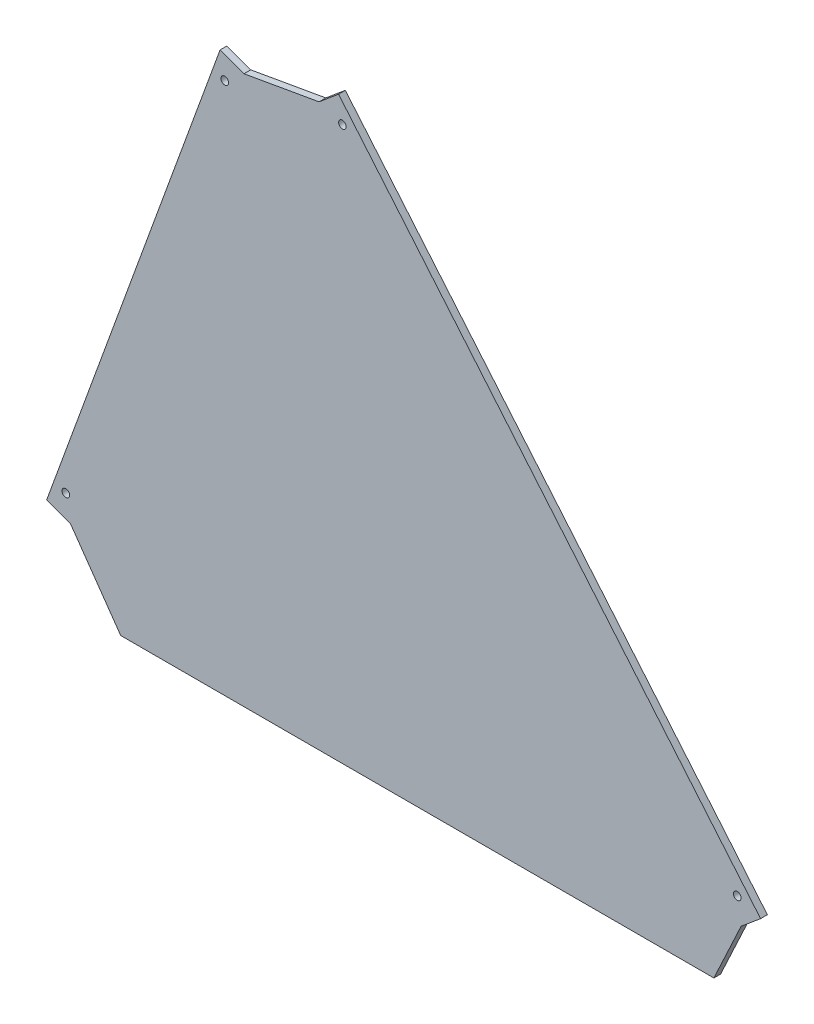
ISO-10303-21;
HEADER;
FILE_DESCRIPTION(('STEP AP214'),'2;1');
FILE_NAME('part.step','',(''),(''),'','','');
FILE_SCHEMA(('AUTOMOTIVE_DESIGN { 1 0 10303 214 1 1 1 1 }'));
ENDSEC;
DATA;
#1=APPLICATION_CONTEXT('core data for automotive mechanical design processes');
#2=APPLICATION_PROTOCOL_DEFINITION('international standard','automotive_design',2000,#1);
#3=PRODUCT_CONTEXT('',#1,'mechanical');
#4=PRODUCT('Part','Part','',(#3));
#5=PRODUCT_RELATED_PRODUCT_CATEGORY('part','',(#4));
#6=PRODUCT_DEFINITION_FORMATION('','',#4);
#7=PRODUCT_DEFINITION_CONTEXT('part definition',#1,'design');
#8=PRODUCT_DEFINITION('design','',#6,#7);
#9=PRODUCT_DEFINITION_SHAPE('','',#8);
#10=(LENGTH_UNIT() NAMED_UNIT(*) SI_UNIT(.MILLI.,.METRE.));
#11=(NAMED_UNIT(*) PLANE_ANGLE_UNIT() SI_UNIT($,.RADIAN.));
#12=(NAMED_UNIT(*) SI_UNIT($,.STERADIAN.) SOLID_ANGLE_UNIT());
#13=UNCERTAINTY_MEASURE_WITH_UNIT(LENGTH_MEASURE(1.E-05),#10,'distance_accuracy_value','');
#14=(GEOMETRIC_REPRESENTATION_CONTEXT(3) GLOBAL_UNCERTAINTY_ASSIGNED_CONTEXT((#13)) GLOBAL_UNIT_ASSIGNED_CONTEXT((#10,
#11,#12)) REPRESENTATION_CONTEXT('',''));
#15=CARTESIAN_POINT('',(0.,0.,0.));
#16=DIRECTION('',(0.,0.,1.));
#17=DIRECTION('',(1.,0.,0.));
#18=AXIS2_PLACEMENT_3D('',#15,#16,#17);
#19=CARTESIAN_POINT('',(324.450552913093,-151.293777515997,4.));
#20=DIRECTION('',(0.906307787036652,-0.422618261740696,0.));
#21=DIRECTION('',(0.422618261740696,0.906307787036652,0.));
#22=AXIS2_PLACEMENT_3D('',#19,#20,#21);
#23=PLANE('',#22);
#24=DIRECTION('',(-0.422618261740696,-0.906307787036652,0.));
#25=VECTOR('',#24,1.);
#26=CARTESIAN_POINT('',(324.450552913093,-151.293777515997,0.));
#27=LINE('',#26,#25);
#28=CARTESIAN_POINT('',(411.074557564106,34.4719999403538,0.));
#29=VERTEX_POINT('',#28);
#30=CARTESIAN_POINT('',(395.,0.,0.));
#31=VERTEX_POINT('',#30);
#32=EDGE_CURVE('E161',#29,#31,#27,.T.);
#33=ORIENTED_EDGE('',*,*,#32,.F.);
#34=DIRECTION('',(0.,0.,-1.));
#35=VECTOR('',#34,1.);
#36=CARTESIAN_POINT('',(411.074557564106,34.4719999403538,4.));
#37=LINE('',#36,#35);
#38=CARTESIAN_POINT('',(411.074557564106,34.4719999403538,4.));
#39=VERTEX_POINT('',#38);
#40=EDGE_CURVE('E11',#39,#29,#37,.T.);
#41=ORIENTED_EDGE('',*,*,#40,.F.);
#42=DIRECTION('',(-0.422618261740696,-0.906307787036652,0.));
#43=VECTOR('',#42,1.);
#44=CARTESIAN_POINT('',(324.450552913093,-151.293777515997,4.));
#45=LINE('',#44,#43);
#46=CARTESIAN_POINT('',(395.,0.,4.));
#47=VERTEX_POINT('',#46);
#48=EDGE_CURVE('E196',#39,#47,#45,.T.);
#49=ORIENTED_EDGE('',*,*,#48,.T.);
#50=DIRECTION('',(0.,0.,-1.));
#51=VECTOR('',#50,1.);
#52=CARTESIAN_POINT('',(395.,0.,4.));
#53=LINE('',#52,#51);
#54=EDGE_CURVE('E66',#47,#31,#53,.T.);
#55=ORIENTED_EDGE('',*,*,#54,.T.);
#56=EDGE_LOOP('',(#33,#41,#49,#55));
#57=FACE_BOUND('',#56,.T.);
#58=ADVANCED_FACE('F49',(#57),#23,.T.);
#59=CARTESIAN_POINT('',(152.871958477384,-182.185705722332,4.));
#60=DIRECTION('',(-0.642787609686544,0.766044443118974,0.));
#61=DIRECTION('',(-0.766044443118974,-0.642787609686544,0.));
#62=AXIS2_PLACEMENT_3D('',#59,#60,#61);
#63=PLANE('',#62);
#64=DIRECTION('',(0.766044443118974,0.642787609686544,0.));
#65=VECTOR('',#64,1.);
#66=CARTESIAN_POINT('',(152.871958477384,-182.185705722332,0.));
#67=LINE('',#66,#65);
#68=CARTESIAN_POINT('',(422.56522421089,44.1138140856518,0.));
#69=VERTEX_POINT('',#68);
#70=EDGE_CURVE('E164',#29,#69,#67,.T.);
#71=ORIENTED_EDGE('',*,*,#70,.T.);
#72=DIRECTION('',(0.,0.,-1.));
#73=VECTOR('',#72,1.);
#74=CARTESIAN_POINT('',(422.56522421089,44.1138140856518,4.));
#75=LINE('',#74,#73);
#76=CARTESIAN_POINT('',(422.56522421089,44.1138140856518,4.));
#77=VERTEX_POINT('',#76);
#78=EDGE_CURVE('E58',#77,#69,#75,.T.);
#79=ORIENTED_EDGE('',*,*,#78,.F.);
#80=DIRECTION('',(0.766044443118974,0.642787609686544,0.));
#81=VECTOR('',#80,1.);
#82=CARTESIAN_POINT('',(152.871958477384,-182.185705722332,4.));
#83=LINE('',#82,#81);
#84=EDGE_CURVE('E238',#39,#77,#83,.T.);
#85=ORIENTED_EDGE('',*,*,#84,.F.);
#86=ORIENTED_EDGE('',*,*,#40,.T.);
#87=EDGE_LOOP('',(#71,#79,#85,#86));
#88=FACE_BOUND('',#87,.T.);
#89=ADVANCED_FACE('F225',(#88),#63,.F.);
#90=CARTESIAN_POINT('',(269.693265733507,226.299519807984,4.));
#91=DIRECTION('',(0.766044443118974,0.642787609686544,0.));
#92=DIRECTION('',(-0.642787609686544,0.766044443118974,0.));
#93=AXIS2_PLACEMENT_3D('',#90,#91,#92);
#94=PLANE('',#93);
#95=DIRECTION('',(0.642787609686544,-0.766044443118974,0.));
#96=VECTOR('',#95,1.);
#97=CARTESIAN_POINT('',(269.693265733507,226.299519807984,0.));
#98=LINE('',#97,#96);
#99=CARTESIAN_POINT('',(173.531323483043,340.90085995581,0.));
#100=VERTEX_POINT('',#99);
#101=EDGE_CURVE('E169',#100,#69,#98,.T.);
#102=ORIENTED_EDGE('',*,*,#101,.F.);
#103=DIRECTION('',(0.,0.,-1.));
#104=VECTOR('',#103,1.);
#105=CARTESIAN_POINT('',(173.531323483043,340.90085995581,4.));
#106=LINE('',#105,#104);
#107=CARTESIAN_POINT('',(173.531323483043,340.90085995581,4.));
#108=VERTEX_POINT('',#107);
#109=EDGE_CURVE('E213',#108,#100,#106,.T.);
#110=ORIENTED_EDGE('',*,*,#109,.F.);
#111=DIRECTION('',(0.642787609686544,-0.766044443118974,0.));
#112=VECTOR('',#111,1.);
#113=CARTESIAN_POINT('',(269.693265733507,226.299519807984,4.));
#114=LINE('',#113,#112);
#115=EDGE_CURVE('E222',#108,#77,#114,.T.);
#116=ORIENTED_EDGE('',*,*,#115,.T.);
#117=ORIENTED_EDGE('',*,*,#78,.T.);
#118=EDGE_LOOP('',(#102,#110,#116,#117));
#119=FACE_BOUND('',#118,.T.);
#120=ADVANCED_FACE('F220',(#119),#94,.T.);
#121=CARTESIAN_POINT('',(-96.1619422504636,114.601340147826,4.));
#122=DIRECTION('',(-0.642787609686543,0.766044443118975,0.));
#123=DIRECTION('',(-0.766044443118975,-0.642787609686543,0.));
#124=AXIS2_PLACEMENT_3D('',#121,#122,#123);
#125=PLANE('',#124);
#126=DIRECTION('',(0.766044443118975,0.642787609686543,0.));
#127=VECTOR('',#126,1.);
#128=CARTESIAN_POINT('',(-96.1619422504636,114.601340147826,0.));
#129=LINE('',#128,#127);
#130=CARTESIAN_POINT('',(162.040656836259,331.259045810512,0.));
#131=VERTEX_POINT('',#130);
#132=EDGE_CURVE('E173',#131,#100,#129,.T.);
#133=ORIENTED_EDGE('',*,*,#132,.F.);
#134=DIRECTION('',(0.,0.,-1.));
#135=VECTOR('',#134,1.);
#136=CARTESIAN_POINT('',(162.040656836259,331.259045810512,4.));
#137=LINE('',#136,#135);
#138=CARTESIAN_POINT('',(162.040656836259,331.259045810512,4.));
#139=VERTEX_POINT('',#138);
#140=EDGE_CURVE('E210',#139,#131,#137,.T.);
#141=ORIENTED_EDGE('',*,*,#140,.F.);
#142=DIRECTION('',(0.766044443118975,0.642787609686543,0.));
#143=VECTOR('',#142,1.);
#144=CARTESIAN_POINT('',(-96.1619422504636,114.601340147826,4.));
#145=LINE('',#144,#143);
#146=EDGE_CURVE('E235',#139,#108,#145,.T.);
#147=ORIENTED_EDGE('',*,*,#146,.T.);
#148=ORIENTED_EDGE('',*,*,#109,.T.);
#149=EDGE_LOOP('',(#133,#141,#147,#148));
#150=FACE_BOUND('',#149,.T.);
#151=ADVANCED_FACE('F232',(#150),#125,.T.);
#152=CARTESIAN_POINT('',(-51.7625094930564,293.559779025753,4.));
#153=DIRECTION('',(-0.173648177666934,0.984807753012207,0.));
#154=DIRECTION('',(-0.984807753012207,-0.173648177666934,0.));
#155=AXIS2_PLACEMENT_3D('',#152,#153,#154);
#156=PLANE('',#155);
#157=DIRECTION('',(0.984807753012207,0.173648177666935,0.));
#158=VECTOR('',#157,1.);
#159=CARTESIAN_POINT('',(-51.7625094930564,293.559779025753,0.));
#160=LINE('',#159,#158);
#161=CARTESIAN_POINT('',(117.724307950709,323.4448778155,0.));
#162=VERTEX_POINT('',#161);
#163=EDGE_CURVE('E176',#162,#131,#160,.T.);
#164=ORIENTED_EDGE('',*,*,#163,.F.);
#165=DIRECTION('',(0.,0.,-1.));
#166=VECTOR('',#165,1.);
#167=CARTESIAN_POINT('',(117.724307950709,323.4448778155,4.));
#168=LINE('',#167,#166);
#169=CARTESIAN_POINT('',(117.724307950709,323.4448778155,4.));
#170=VERTEX_POINT('',#169);
#171=EDGE_CURVE('E207',#170,#162,#168,.T.);
#172=ORIENTED_EDGE('',*,*,#171,.F.);
#173=DIRECTION('',(0.984807753012207,0.173648177666935,0.));
#174=VECTOR('',#173,1.);
#175=CARTESIAN_POINT('',(-51.7625094930564,293.559779025753,4.));
#176=LINE('',#175,#174);
#177=EDGE_CURVE('E242',#170,#139,#176,.T.);
#178=ORIENTED_EDGE('',*,*,#177,.T.);
#179=ORIENTED_EDGE('',*,*,#140,.T.);
#180=EDGE_LOOP('',(#164,#172,#178,#179));
#181=FACE_BOUND('',#180,.T.);
#182=ADVANCED_FACE('F337',(#181),#156,.T.);
#183=CARTESIAN_POINT('',(117.724307950709,323.4448778155,4.));
#184=DIRECTION('',(-0.342020143325665,-0.93969262078591,0.));
#185=DIRECTION('',(0.93969262078591,-0.342020143325665,0.));
#186=AXIS2_PLACEMENT_3D('',#183,#184,#185);
#187=PLANE('',#186);
#188=DIRECTION('',(-0.93969262078591,0.342020143325665,0.));
#189=VECTOR('',#188,1.);
#190=CARTESIAN_POINT('',(117.724307950709,323.4448778155,0.));
#191=LINE('',#190,#189);
#192=CARTESIAN_POINT('',(103.628918638921,328.575179965385,0.));
#193=VERTEX_POINT('',#192);
#194=EDGE_CURVE('E180',#162,#193,#191,.T.);
#195=ORIENTED_EDGE('',*,*,#194,.T.);
#196=DIRECTION('',(0.,0.,-1.));
#197=VECTOR('',#196,1.);
#198=CARTESIAN_POINT('',(103.628918638921,328.575179965385,4.));
#199=LINE('',#198,#197);
#200=CARTESIAN_POINT('',(103.628918638921,328.575179965385,4.));
#201=VERTEX_POINT('',#200);
#202=EDGE_CURVE('E203',#201,#193,#199,.T.);
#203=ORIENTED_EDGE('',*,*,#202,.F.);
#204=DIRECTION('',(-0.93969262078591,0.342020143325665,0.));
#205=VECTOR('',#204,1.);
#206=CARTESIAN_POINT('',(117.724307950709,323.4448778155,4.));
#207=LINE('',#206,#205);
#208=EDGE_CURVE('E250',#170,#201,#207,.T.);
#209=ORIENTED_EDGE('',*,*,#208,.F.);
#210=ORIENTED_EDGE('',*,*,#171,.T.);
#211=EDGE_LOOP('',(#195,#203,#209,#210));
#212=FACE_BOUND('',#211,.T.);
#213=ADVANCED_FACE('F333',(#212),#187,.F.);
#214=CARTESIAN_POINT('',(-14.0953893117887,5.130302149885,4.));
#215=DIRECTION('',(0.93969262078591,-0.342020143325666,0.));
#216=DIRECTION('',(0.342020143325666,0.93969262078591,0.));
#217=AXIS2_PLACEMENT_3D('',#214,#215,#216);
#218=PLANE('',#217);
#219=DIRECTION('',(-0.342020143325666,-0.93969262078591,0.));
#220=VECTOR('',#219,1.);
#221=CARTESIAN_POINT('',(-14.0953893117887,5.130302149885,0.));
#222=LINE('',#221,#220);
#223=CARTESIAN_POINT('',(1.29551713786626,47.4164700852509,0.));
#224=VERTEX_POINT('',#223);
#225=EDGE_CURVE('E183',#193,#224,#222,.T.);
#226=ORIENTED_EDGE('',*,*,#225,.T.);
#227=DIRECTION('',(0.,0.,-1.));
#228=VECTOR('',#227,1.);
#229=CARTESIAN_POINT('',(1.29551713786626,47.4164700852509,4.));
#230=LINE('',#229,#228);
#231=CARTESIAN_POINT('',(1.29551713786626,47.4164700852509,4.));
#232=VERTEX_POINT('',#231);
#233=EDGE_CURVE('E138',#232,#224,#230,.T.);
#234=ORIENTED_EDGE('',*,*,#233,.F.);
#235=DIRECTION('',(-0.342020143325666,-0.93969262078591,0.));
#236=VECTOR('',#235,1.);
#237=CARTESIAN_POINT('',(-14.0953893117887,5.130302149885,4.));
#238=LINE('',#237,#236);
#239=EDGE_CURVE('E147',#201,#232,#238,.T.);
#240=ORIENTED_EDGE('',*,*,#239,.F.);
#241=ORIENTED_EDGE('',*,*,#202,.T.);
#242=EDGE_LOOP('',(#226,#234,#240,#241));
#243=FACE_BOUND('',#242,.T.);
#244=ADVANCED_FACE('F330',(#243),#218,.F.);
#245=CARTESIAN_POINT('',(15.390906449655,42.2861679353659,4.));
#246=DIRECTION('',(-0.342020143325666,-0.939692620785909,0.));
#247=DIRECTION('',(0.93969262078591,-0.342020143325666,0.));
#248=AXIS2_PLACEMENT_3D('',#245,#246,#247);
#249=PLANE('',#248);
#250=DIRECTION('',(-0.93969262078591,0.342020143325666,0.));
#251=VECTOR('',#250,1.);
#252=CARTESIAN_POINT('',(15.390906449655,42.2861679353659,0.));
#253=LINE('',#252,#251);
#254=CARTESIAN_POINT('',(15.3909064496549,42.2861679353659,0.));
#255=VERTEX_POINT('',#254);
#256=EDGE_CURVE('E133',#255,#224,#253,.T.);
#257=ORIENTED_EDGE('',*,*,#256,.F.);
#258=DIRECTION('',(0.,0.,-1.));
#259=VECTOR('',#258,1.);
#260=CARTESIAN_POINT('',(15.3909064496549,42.2861679353659,4.));
#261=LINE('',#260,#259);
#262=CARTESIAN_POINT('',(15.3909064496549,42.2861679353659,4.));
#263=VERTEX_POINT('',#262);
#264=EDGE_CURVE('E128',#263,#255,#261,.T.);
#265=ORIENTED_EDGE('',*,*,#264,.F.);
#266=DIRECTION('',(-0.93969262078591,0.342020143325666,0.));
#267=VECTOR('',#266,1.);
#268=CARTESIAN_POINT('',(15.390906449655,42.2861679353659,4.));
#269=LINE('',#268,#267);
#270=EDGE_CURVE('E131',#263,#232,#269,.T.);
#271=ORIENTED_EDGE('',*,*,#270,.T.);
#272=ORIENTED_EDGE('',*,*,#233,.T.);
#273=EDGE_LOOP('',(#257,#265,#271,#272));
#274=FACE_BOUND('',#273,.T.);
#275=ADVANCED_FACE('F130',(#274),#249,.T.);
#276=CARTESIAN_POINT('',(30.1954532248275,21.143083967683,4.));
#277=DIRECTION('',(-0.819152044288991,-0.573576436351047,0.));
#278=DIRECTION('',(0.573576436351047,-0.819152044288991,0.));
#279=AXIS2_PLACEMENT_3D('',#276,#277,#278);
#280=PLANE('',#279);
#281=DIRECTION('',(-0.573576436351047,0.819152044288991,0.));
#282=VECTOR('',#281,1.);
#283=CARTESIAN_POINT('',(30.1954532248275,21.143083967683,0.));
#284=LINE('',#283,#282);
#285=CARTESIAN_POINT('',(45.,0.,0.));
#286=VERTEX_POINT('',#285);
#287=EDGE_CURVE('E189',#286,#255,#284,.T.);
#288=ORIENTED_EDGE('',*,*,#287,.F.);
#289=DIRECTION('',(0.,0.,-1.));
#290=VECTOR('',#289,1.);
#291=CARTESIAN_POINT('',(45.,0.,4.));
#292=LINE('',#291,#290);
#293=CARTESIAN_POINT('',(45.,0.,4.));
#294=VERTEX_POINT('',#293);
#295=EDGE_CURVE('E97',#294,#286,#292,.T.);
#296=ORIENTED_EDGE('',*,*,#295,.F.);
#297=DIRECTION('',(-0.573576436351047,0.819152044288991,0.));
#298=VECTOR('',#297,1.);
#299=CARTESIAN_POINT('',(30.1954532248275,21.143083967683,4.));
#300=LINE('',#299,#298);
#301=EDGE_CURVE('E145',#294,#263,#300,.T.);
#302=ORIENTED_EDGE('',*,*,#301,.T.);
#303=ORIENTED_EDGE('',*,*,#264,.T.);
#304=EDGE_LOOP('',(#288,#296,#302,#303));
#305=FACE_BOUND('',#304,.T.);
#306=ADVANCED_FACE('F151',(#305),#280,.T.);
#307=CARTESIAN_POINT('',(0.,0.,4.));
#308=DIRECTION('',(0.,-1.,0.));
#309=DIRECTION('',(1.,0.,0.));
#310=AXIS2_PLACEMENT_3D('',#307,#308,#309);
#311=PLANE('',#310);
#312=DIRECTION('',(-1.,0.,0.));
#313=VECTOR('',#312,1.);
#314=CARTESIAN_POINT('',(0.,0.,0.));
#315=LINE('',#314,#313);
#316=EDGE_CURVE('E192',#31,#286,#315,.T.);
#317=ORIENTED_EDGE('',*,*,#316,.F.);
#318=ORIENTED_EDGE('',*,*,#54,.F.);
#319=DIRECTION('',(-1.,0.,0.));
#320=VECTOR('',#319,1.);
#321=CARTESIAN_POINT('',(0.,0.,4.));
#322=LINE('',#321,#320);
#323=EDGE_CURVE('E153',#47,#294,#322,.T.);
#324=ORIENTED_EDGE('',*,*,#323,.T.);
#325=ORIENTED_EDGE('',*,*,#295,.T.);
#326=EDGE_LOOP('',(#317,#318,#324,#325));
#327=FACE_BOUND('',#326,.T.);
#328=ADVANCED_FACE('F300',(#327),#311,.T.);
#329=CARTESIAN_POINT('',(0.,0.,4.));
#330=DIRECTION('',(0.,0.,1.));
#331=DIRECTION('',(1.,0.,0.));
#332=AXIS2_PLACEMENT_3D('',#329,#330,#331);
#333=PLANE('',#332);
#334=CARTESIAN_POINT('',(106.401361503244,314.263871130618,4.));
#335=DIRECTION('',(0.,0.,1.));
#336=DIRECTION('',(1.,0.,0.));
#337=AXIS2_PLACEMENT_3D('',#334,#335,#336);
#338=CIRCLE('',#337,2.25);
#339=CARTESIAN_POINT('',(108.651361503244,314.263871130618,4.));
#340=VERTEX_POINT('',#339);
#341=EDGE_CURVE('E275',#340,#340,#338,.T.);
#342=ORIENTED_EDGE('',*,*,#341,.F.);
#343=EDGE_LOOP('',(#342));
#344=FACE_BOUND('',#343,.T.);
#345=CARTESIAN_POINT('',(12.6184635853324,56.5974767701319,4.));
#346=DIRECTION('',(0.,0.,1.));
#347=DIRECTION('',(1.,0.,0.));
#348=AXIS2_PLACEMENT_3D('',#345,#346,#347);
#349=CIRCLE('',#348,2.25);
#350=CARTESIAN_POINT('',(14.8684635853324,56.5974767701319,4.));
#351=VERTEX_POINT('',#350);
#352=EDGE_CURVE('E264',#351,#351,#349,.T.);
#353=ORIENTED_EDGE('',*,*,#352,.F.);
#354=EDGE_LOOP('',(#353));
#355=FACE_BOUND('',#354,.T.);
#356=CARTESIAN_POINT('',(175.820835280733,326.504397344174,4.));
#357=DIRECTION('',(0.,0.,1.));
#358=DIRECTION('',(1.,0.,0.));
#359=AXIS2_PLACEMENT_3D('',#356,#357,#358);
#360=CIRCLE('',#359,2.25);
#361=CARTESIAN_POINT('',(178.070835280733,326.504397344174,4.));
#362=VERTEX_POINT('',#361);
#363=EDGE_CURVE('E257',#362,#362,#360,.T.);
#364=ORIENTED_EDGE('',*,*,#363,.F.);
#365=EDGE_LOOP('',(#364));
#366=FACE_BOUND('',#365,.T.);
#367=CARTESIAN_POINT('',(408.785045766416,48.8684625519899,4.));
#368=DIRECTION('',(0.,0.,1.));
#369=DIRECTION('',(1.,0.,0.));
#370=AXIS2_PLACEMENT_3D('',#367,#368,#369);
#371=CIRCLE('',#370,2.24999999999997);
#372=CARTESIAN_POINT('',(411.035045766416,48.8684625519899,4.));
#373=VERTEX_POINT('',#372);
#374=EDGE_CURVE('E255',#373,#373,#371,.T.);
#375=ORIENTED_EDGE('',*,*,#374,.F.);
#376=EDGE_LOOP('',(#375));
#377=FACE_BOUND('',#376,.T.);
#378=ORIENTED_EDGE('',*,*,#48,.F.);
#379=ORIENTED_EDGE('',*,*,#84,.T.);
#380=ORIENTED_EDGE('',*,*,#115,.F.);
#381=ORIENTED_EDGE('',*,*,#146,.F.);
#382=ORIENTED_EDGE('',*,*,#177,.F.);
#383=ORIENTED_EDGE('',*,*,#208,.T.);
#384=ORIENTED_EDGE('',*,*,#239,.T.);
#385=ORIENTED_EDGE('',*,*,#270,.F.);
#386=ORIENTED_EDGE('',*,*,#301,.F.);
#387=ORIENTED_EDGE('',*,*,#323,.F.);
#388=EDGE_LOOP('',(#378,#379,#380,#381,#382,#383,#384,#385,#386,#387));
#389=FACE_BOUND('',#388,.T.);
#390=ADVANCED_FACE('F143',(#344,#355,#366,#377,#389),#333,.T.);
#391=CARTESIAN_POINT('',(0.,0.,0.));
#392=DIRECTION('',(0.,0.,1.));
#393=DIRECTION('',(1.,0.,0.));
#394=AXIS2_PLACEMENT_3D('',#391,#392,#393);
#395=PLANE('',#394);
#396=CARTESIAN_POINT('',(106.401361503244,314.263871130618,0.));
#397=DIRECTION('',(0.,0.,1.));
#398=DIRECTION('',(1.,0.,0.));
#399=AXIS2_PLACEMENT_3D('',#396,#397,#398);
#400=CIRCLE('',#399,2.25);
#401=CARTESIAN_POINT('',(108.651361503244,314.263871130618,0.));
#402=VERTEX_POINT('',#401);
#403=EDGE_CURVE('E266',#402,#402,#400,.T.);
#404=ORIENTED_EDGE('',*,*,#403,.T.);
#405=EDGE_LOOP('',(#404));
#406=FACE_BOUND('',#405,.T.);
#407=CARTESIAN_POINT('',(12.6184635853324,56.5974767701319,0.));
#408=DIRECTION('',(0.,0.,1.));
#409=DIRECTION('',(1.,0.,0.));
#410=AXIS2_PLACEMENT_3D('',#407,#408,#409);
#411=CIRCLE('',#410,2.25);
#412=CARTESIAN_POINT('',(14.8684635853324,56.5974767701319,0.));
#413=VERTEX_POINT('',#412);
#414=EDGE_CURVE('E260',#413,#413,#411,.T.);
#415=ORIENTED_EDGE('',*,*,#414,.T.);
#416=EDGE_LOOP('',(#415));
#417=FACE_BOUND('',#416,.T.);
#418=CARTESIAN_POINT('',(175.820835280733,326.504397344174,0.));
#419=DIRECTION('',(0.,0.,1.));
#420=DIRECTION('',(1.,0.,0.));
#421=AXIS2_PLACEMENT_3D('',#418,#419,#420);
#422=CIRCLE('',#421,2.25);
#423=CARTESIAN_POINT('',(178.070835280733,326.504397344174,0.));
#424=VERTEX_POINT('',#423);
#425=EDGE_CURVE('E259',#424,#424,#422,.T.);
#426=ORIENTED_EDGE('',*,*,#425,.T.);
#427=EDGE_LOOP('',(#426));
#428=FACE_BOUND('',#427,.T.);
#429=CARTESIAN_POINT('',(408.785045766416,48.8684625519899,0.));
#430=DIRECTION('',(0.,0.,1.));
#431=DIRECTION('',(1.,0.,0.));
#432=AXIS2_PLACEMENT_3D('',#429,#430,#431);
#433=CIRCLE('',#432,2.24999999999997);
#434=CARTESIAN_POINT('',(411.035045766416,48.8684625519899,0.));
#435=VERTEX_POINT('',#434);
#436=EDGE_CURVE('E165',#435,#435,#433,.T.);
#437=ORIENTED_EDGE('',*,*,#436,.T.);
#438=EDGE_LOOP('',(#437));
#439=FACE_BOUND('',#438,.T.);
#440=ORIENTED_EDGE('',*,*,#32,.T.);
#441=ORIENTED_EDGE('',*,*,#316,.T.);
#442=ORIENTED_EDGE('',*,*,#287,.T.);
#443=ORIENTED_EDGE('',*,*,#256,.T.);
#444=ORIENTED_EDGE('',*,*,#225,.F.);
#445=ORIENTED_EDGE('',*,*,#194,.F.);
#446=ORIENTED_EDGE('',*,*,#163,.T.);
#447=ORIENTED_EDGE('',*,*,#132,.T.);
#448=ORIENTED_EDGE('',*,*,#101,.T.);
#449=ORIENTED_EDGE('',*,*,#70,.F.);
#450=EDGE_LOOP('',(#440,#441,#442,#443,#444,#445,#446,#447,#448,#449));
#451=FACE_BOUND('',#450,.T.);
#452=ADVANCED_FACE('F227',(#406,#417,#428,#439,#451),#395,.F.);
#453=CARTESIAN_POINT('',(408.785045766416,48.8684625519899,4.));
#454=DIRECTION('',(0.,0.,1.));
#455=DIRECTION('',(1.,0.,0.));
#456=AXIS2_PLACEMENT_3D('',#453,#454,#455);
#457=CYLINDRICAL_SURFACE('',#456,2.24999999999997);
#458=ORIENTED_EDGE('',*,*,#436,.F.);
#459=EDGE_LOOP('',(#458));
#460=FACE_BOUND('',#459,.T.);
#461=ORIENTED_EDGE('',*,*,#374,.T.);
#462=EDGE_LOOP('',(#461));
#463=FACE_BOUND('',#462,.T.);
#464=ADVANCED_FACE('F307',(#460,#463),#457,.F.);
#465=CARTESIAN_POINT('',(175.820835280733,326.504397344174,4.));
#466=DIRECTION('',(0.,0.,1.));
#467=DIRECTION('',(1.,0.,0.));
#468=AXIS2_PLACEMENT_3D('',#465,#466,#467);
#469=CYLINDRICAL_SURFACE('',#468,2.25);
#470=ORIENTED_EDGE('',*,*,#425,.F.);
#471=EDGE_LOOP('',(#470));
#472=FACE_BOUND('',#471,.T.);
#473=ORIENTED_EDGE('',*,*,#363,.T.);
#474=EDGE_LOOP('',(#473));
#475=FACE_BOUND('',#474,.T.);
#476=ADVANCED_FACE('F294',(#472,#475),#469,.F.);
#477=CARTESIAN_POINT('',(12.6184635853324,56.5974767701319,4.));
#478=DIRECTION('',(0.,0.,1.));
#479=DIRECTION('',(1.,0.,0.));
#480=AXIS2_PLACEMENT_3D('',#477,#478,#479);
#481=CYLINDRICAL_SURFACE('',#480,2.25);
#482=ORIENTED_EDGE('',*,*,#414,.F.);
#483=EDGE_LOOP('',(#482));
#484=FACE_BOUND('',#483,.T.);
#485=ORIENTED_EDGE('',*,*,#352,.T.);
#486=EDGE_LOOP('',(#485));
#487=FACE_BOUND('',#486,.T.);
#488=ADVANCED_FACE('F290',(#484,#487),#481,.F.);
#489=CARTESIAN_POINT('',(106.401361503244,314.263871130618,4.));
#490=DIRECTION('',(0.,0.,1.));
#491=DIRECTION('',(1.,0.,0.));
#492=AXIS2_PLACEMENT_3D('',#489,#490,#491);
#493=CYLINDRICAL_SURFACE('',#492,2.25);
#494=ORIENTED_EDGE('',*,*,#403,.F.);
#495=EDGE_LOOP('',(#494));
#496=FACE_BOUND('',#495,.T.);
#497=ORIENTED_EDGE('',*,*,#341,.T.);
#498=EDGE_LOOP('',(#497));
#499=FACE_BOUND('',#498,.T.);
#500=ADVANCED_FACE('F293',(#496,#499),#493,.F.);
#501=CLOSED_SHELL('',(#58,#89,#120,#151,#182,#213,#244,#275,#306,#328,#390,#452,#464,#476,#488,#500));
#502=MANIFOLD_SOLID_BREP('B2',#501);
#503=ADVANCED_BREP_SHAPE_REPRESENTATION('',(#18,#502),#14);
#504=SHAPE_DEFINITION_REPRESENTATION(#9,#503);
ENDSEC;
END-ISO-10303-21;
